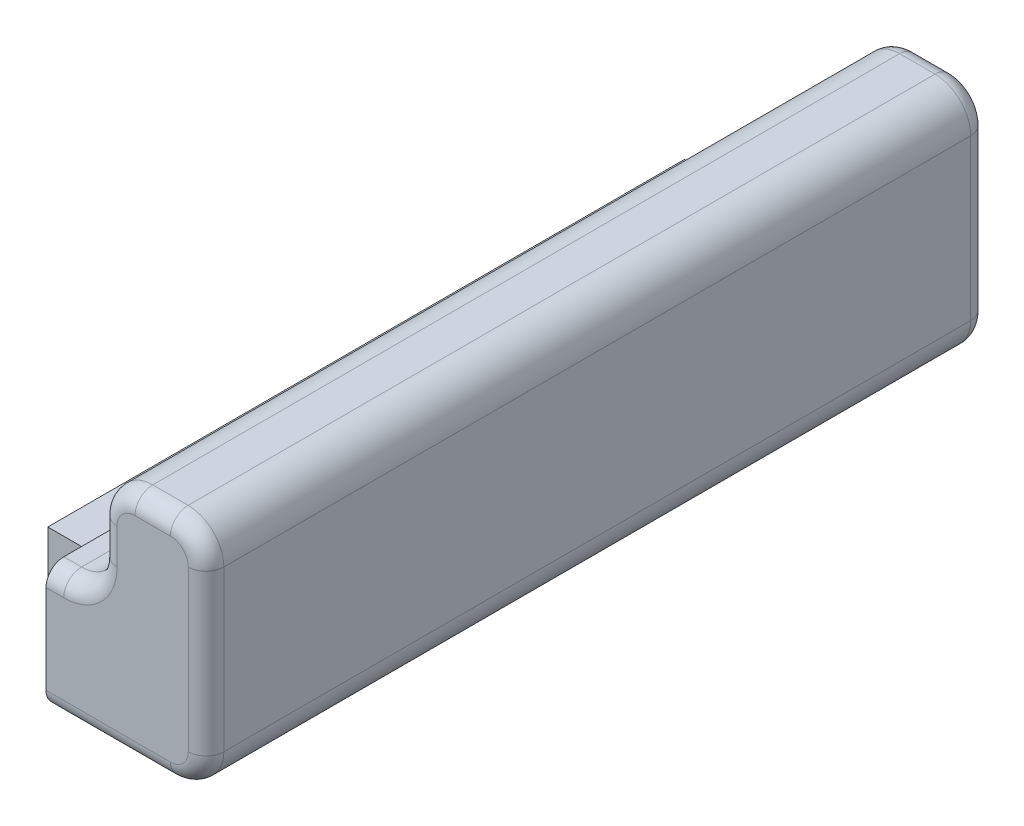
ISO-10303-21;
HEADER;
FILE_DESCRIPTION(('STEP AP214'),'2;1');
FILE_NAME('part.step','',(''),(''),'','','');
FILE_SCHEMA(('AUTOMOTIVE_DESIGN { 1 0 10303 214 1 1 1 1 }'));
ENDSEC;
DATA;
#1=APPLICATION_CONTEXT('core data for automotive mechanical design processes');
#2=APPLICATION_PROTOCOL_DEFINITION('international standard','automotive_design',2000,#1);
#3=PRODUCT_CONTEXT('',#1,'mechanical');
#4=PRODUCT('Part','Part','',(#3));
#5=PRODUCT_RELATED_PRODUCT_CATEGORY('part','',(#4));
#6=PRODUCT_DEFINITION_FORMATION('','',#4);
#7=PRODUCT_DEFINITION_CONTEXT('part definition',#1,'design');
#8=PRODUCT_DEFINITION('design','',#6,#7);
#9=PRODUCT_DEFINITION_SHAPE('','',#8);
#10=(LENGTH_UNIT() NAMED_UNIT(*) SI_UNIT(.MILLI.,.METRE.));
#11=(NAMED_UNIT(*) PLANE_ANGLE_UNIT() SI_UNIT($,.RADIAN.));
#12=(NAMED_UNIT(*) SI_UNIT($,.STERADIAN.) SOLID_ANGLE_UNIT());
#13=UNCERTAINTY_MEASURE_WITH_UNIT(LENGTH_MEASURE(1.E-05),#10,'distance_accuracy_value','');
#14=(GEOMETRIC_REPRESENTATION_CONTEXT(3) GLOBAL_UNCERTAINTY_ASSIGNED_CONTEXT((#13)) GLOBAL_UNIT_ASSIGNED_CONTEXT((#10,
#11,#12)) REPRESENTATION_CONTEXT('',''));
#15=CARTESIAN_POINT('',(0.,0.,0.));
#16=DIRECTION('',(0.,0.,1.));
#17=DIRECTION('',(1.,0.,0.));
#18=AXIS2_PLACEMENT_3D('',#15,#16,#17);
#19=CARTESIAN_POINT('',(-5.9507233877171,-1.66772154656018,22.));
#20=DIRECTION('',(1.,0.,0.));
#21=DIRECTION('',(0.,0.,-1.));
#22=AXIS2_PLACEMENT_3D('',#19,#20,#21);
#23=PLANE('',#22);
#24=DIRECTION('',(0.,0.,-1.));
#25=VECTOR('',#24,1.);
#26=CARTESIAN_POINT('',(-5.9507233877171,-5.16772154656018,22.));
#27=LINE('',#26,#25);
#28=CARTESIAN_POINT('',(-5.9507233877171,-5.16772154656018,21.5));
#29=VERTEX_POINT('',#28);
#30=CARTESIAN_POINT('',(-5.9507233877171,-5.16772154656018,0.5));
#31=VERTEX_POINT('',#30);
#32=EDGE_CURVE('E233',#29,#31,#27,.T.);
#33=ORIENTED_EDGE('',*,*,#32,.F.);
#34=CARTESIAN_POINT('',(-5.9507233877171,-4.66772154656018,21.5));
#35=DIRECTION('',(1.,0.,0.));
#36=DIRECTION('',(0.,0.,-1.));
#37=AXIS2_PLACEMENT_3D('',#34,#35,#36);
#38=CIRCLE('',#37,0.5);
#39=CARTESIAN_POINT('',(-5.9507233877171,-4.66772154656018,22.));
#40=VERTEX_POINT('',#39);
#41=EDGE_CURVE('E290',#29,#40,#38,.F.);
#42=ORIENTED_EDGE('',*,*,#41,.T.);
#43=DIRECTION('',(0.,-1.,0.));
#44=VECTOR('',#43,1.);
#45=CARTESIAN_POINT('',(-5.9507233877171,-1.66772154656018,22.));
#46=LINE('',#45,#44);
#47=CARTESIAN_POINT('',(-5.9507233877171,-2.16772154656018,22.));
#48=VERTEX_POINT('',#47);
#49=EDGE_CURVE('E223',#48,#40,#46,.T.);
#50=ORIENTED_EDGE('',*,*,#49,.F.);
#51=CARTESIAN_POINT('',(-5.9507233877171,-2.16772154656018,21.5));
#52=DIRECTION('',(1.,0.,0.));
#53=DIRECTION('',(0.,0.,-1.));
#54=AXIS2_PLACEMENT_3D('',#51,#52,#53);
#55=CIRCLE('',#54,0.5);
#56=CARTESIAN_POINT('',(-5.9507233877171,-1.66772154656018,21.5));
#57=VERTEX_POINT('',#56);
#58=EDGE_CURVE('E286',#48,#57,#55,.F.);
#59=ORIENTED_EDGE('',*,*,#58,.T.);
#60=DIRECTION('',(0.,0.,-1.));
#61=VECTOR('',#60,1.);
#62=CARTESIAN_POINT('',(-5.9507233877171,-1.66772154656018,22.));
#63=LINE('',#62,#61);
#64=CARTESIAN_POINT('',(-5.9507233877171,-1.66772154656018,0.5));
#65=VERTEX_POINT('',#64);
#66=EDGE_CURVE('E236',#57,#65,#63,.T.);
#67=ORIENTED_EDGE('',*,*,#66,.T.);
#68=CARTESIAN_POINT('',(-5.9507233877171,-2.16772154656018,0.5));
#69=DIRECTION('',(1.,0.,0.));
#70=DIRECTION('',(0.,0.,-1.));
#71=AXIS2_PLACEMENT_3D('',#68,#69,#70);
#72=CIRCLE('',#71,0.5);
#73=CARTESIAN_POINT('',(-5.9507233877171,-2.16772154656018,0.));
#74=VERTEX_POINT('',#73);
#75=EDGE_CURVE('E284',#65,#74,#72,.F.);
#76=ORIENTED_EDGE('',*,*,#75,.T.);
#77=DIRECTION('',(0.,-1.,0.));
#78=VECTOR('',#77,1.);
#79=CARTESIAN_POINT('',(-5.9507233877171,-1.66772154656018,0.));
#80=LINE('',#79,#78);
#81=CARTESIAN_POINT('',(-5.9507233877171,-4.66772154656018,0.));
#82=VERTEX_POINT('',#81);
#83=EDGE_CURVE('E227',#74,#82,#80,.T.);
#84=ORIENTED_EDGE('',*,*,#83,.T.);
#85=CARTESIAN_POINT('',(-5.9507233877171,-4.66772154656018,0.5));
#86=DIRECTION('',(1.,0.,0.));
#87=DIRECTION('',(0.,0.,-1.));
#88=AXIS2_PLACEMENT_3D('',#85,#86,#87);
#89=CIRCLE('',#88,0.5);
#90=EDGE_CURVE('E288',#82,#31,#89,.F.);
#91=ORIENTED_EDGE('',*,*,#90,.T.);
#92=EDGE_LOOP('',(#33,#42,#50,#59,#67,#76,#84,#91));
#93=FACE_BOUND('',#92,.T.);
#94=DIRECTION('',(0.,-1.,0.));
#95=VECTOR('',#94,1.);
#96=CARTESIAN_POINT('',(-5.9507233877171,-2.71772154656018,2.05));
#97=LINE('',#96,#95);
#98=CARTESIAN_POINT('',(-5.9507233877171,-2.71772154656018,2.05));
#99=VERTEX_POINT('',#98);
#100=CARTESIAN_POINT('',(-5.9507233877171,-4.11772154656018,2.05));
#101=VERTEX_POINT('',#100);
#102=EDGE_CURVE('E50',#99,#101,#97,.T.);
#103=ORIENTED_EDGE('',*,*,#102,.F.);
#104=DIRECTION('',(0.,0.,-1.));
#105=VECTOR('',#104,1.);
#106=CARTESIAN_POINT('',(-5.9507233877171,-2.71772154656018,2.05));
#107=LINE('',#106,#105);
#108=CARTESIAN_POINT('',(-5.9507233877171,-2.71772154656018,19.95));
#109=VERTEX_POINT('',#108);
#110=EDGE_CURVE('E54',#109,#99,#107,.T.);
#111=ORIENTED_EDGE('',*,*,#110,.F.);
#112=DIRECTION('',(0.,1.,0.));
#113=VECTOR('',#112,1.);
#114=CARTESIAN_POINT('',(-5.9507233877171,-2.71772154656018,19.95));
#115=LINE('',#114,#113);
#116=CARTESIAN_POINT('',(-5.9507233877171,-4.11772154656018,19.95));
#117=VERTEX_POINT('',#116);
#118=EDGE_CURVE('E788',#117,#109,#115,.T.);
#119=ORIENTED_EDGE('',*,*,#118,.F.);
#120=DIRECTION('',(0.,0.,1.));
#121=VECTOR('',#120,1.);
#122=CARTESIAN_POINT('',(-5.9507233877171,-4.11772154656018,2.05));
#123=LINE('',#122,#121);
#124=EDGE_CURVE('E794',#101,#117,#123,.T.);
#125=ORIENTED_EDGE('',*,*,#124,.F.);
#126=EDGE_LOOP('',(#103,#111,#119,#125));
#127=FACE_BOUND('',#126,.T.);
#128=ADVANCED_FACE('F33',(#93,#127),#23,.F.);
#129=CARTESIAN_POINT('',(-2.45284962289796,-4.16559531137933,22.));
#130=DIRECTION('',(0.,0.,-1.));
#131=DIRECTION('',(-1.,0.,0.));
#132=AXIS2_PLACEMENT_3D('',#129,#130,#131);
#133=CYLINDRICAL_SURFACE('',#132,1.00212623518086);
#134=DIRECTION('',(0.,0.,-1.));
#135=VECTOR('',#134,1.);
#136=CARTESIAN_POINT('',(-1.4507233877171,-4.16559531137933,22.));
#137=LINE('',#136,#135);
#138=CARTESIAN_POINT('',(-1.4507233877171,-4.16559531137933,21.5));
#139=VERTEX_POINT('',#138);
#140=CARTESIAN_POINT('',(-1.4507233877171,-4.16559531137933,0.5));
#141=VERTEX_POINT('',#140);
#142=EDGE_CURVE('E257',#139,#141,#137,.T.);
#143=ORIENTED_EDGE('',*,*,#142,.F.);
#144=CARTESIAN_POINT('',(-2.45284962289796,-4.16559531137933,21.5));
#145=DIRECTION('',(0.,0.,-1.));
#146=DIRECTION('',(-1.,0.,0.));
#147=AXIS2_PLACEMENT_3D('',#144,#145,#146);
#148=CIRCLE('',#147,1.00212623518086);
#149=CARTESIAN_POINT('',(-2.45284962289796,-5.16772154656018,21.5));
#150=VERTEX_POINT('',#149);
#151=EDGE_CURVE('E11',#139,#150,#148,.T.);
#152=ORIENTED_EDGE('',*,*,#151,.T.);
#153=DIRECTION('',(0.,0.,-1.));
#154=VECTOR('',#153,1.);
#155=CARTESIAN_POINT('',(-2.45284962289796,-5.16772154656018,22.));
#156=LINE('',#155,#154);
#157=CARTESIAN_POINT('',(-2.45284962289796,-5.16772154656018,0.5));
#158=VERTEX_POINT('',#157);
#159=EDGE_CURVE('E226',#150,#158,#156,.T.);
#160=ORIENTED_EDGE('',*,*,#159,.T.);
#161=CARTESIAN_POINT('',(-2.45284962289796,-4.16559531137933,0.5));
#162=DIRECTION('',(0.,0.,-1.));
#163=DIRECTION('',(-1.,0.,0.));
#164=AXIS2_PLACEMENT_3D('',#161,#162,#163);
#165=CIRCLE('',#164,1.00212623518086);
#166=EDGE_CURVE('E42',#158,#141,#165,.F.);
#167=ORIENTED_EDGE('',*,*,#166,.T.);
#168=EDGE_LOOP('',(#143,#152,#160,#167));
#169=FACE_BOUND('',#168,.T.);
#170=ADVANCED_FACE('F461',(#169),#133,.T.);
#171=CARTESIAN_POINT('',(-1.4507233877171,0.332278453427185,22.));
#172=DIRECTION('',(-1.,0.,0.));
#173=DIRECTION('',(0.,0.,1.));
#174=AXIS2_PLACEMENT_3D('',#171,#172,#173);
#175=PLANE('',#174);
#176=DIRECTION('',(0.,0.,-1.));
#177=VECTOR('',#176,1.);
#178=CARTESIAN_POINT('',(-1.4507233877171,0.332278453427185,22.));
#179=LINE('',#178,#177);
#180=CARTESIAN_POINT('',(-1.4507233877171,0.332278453427185,21.5));
#181=VERTEX_POINT('',#180);
#182=CARTESIAN_POINT('',(-1.4507233877171,0.332278453427185,0.5));
#183=VERTEX_POINT('',#182);
#184=EDGE_CURVE('E254',#181,#183,#179,.T.);
#185=ORIENTED_EDGE('',*,*,#184,.F.);
#186=DIRECTION('',(0.,1.,0.));
#187=VECTOR('',#186,1.);
#188=CARTESIAN_POINT('',(-1.4507233877171,0.332278453427185,21.5));
#189=LINE('',#188,#187);
#190=EDGE_CURVE('E336',#181,#139,#189,.F.);
#191=ORIENTED_EDGE('',*,*,#190,.T.);
#192=ORIENTED_EDGE('',*,*,#142,.T.);
#193=DIRECTION('',(0.,1.,0.));
#194=VECTOR('',#193,1.);
#195=CARTESIAN_POINT('',(-1.4507233877171,0.332278453427185,0.5));
#196=LINE('',#195,#194);
#197=EDGE_CURVE('E334',#141,#183,#196,.T.);
#198=ORIENTED_EDGE('',*,*,#197,.T.);
#199=EDGE_LOOP('',(#185,#191,#192,#198));
#200=FACE_BOUND('',#199,.T.);
#201=ADVANCED_FACE('F466',(#200),#175,.F.);
#202=CARTESIAN_POINT('',(-2.45284962289796,0.332278453427185,22.));
#203=DIRECTION('',(0.,0.,-1.));
#204=DIRECTION('',(-1.,0.,0.));
#205=AXIS2_PLACEMENT_3D('',#202,#203,#204);
#206=CYLINDRICAL_SURFACE('',#205,1.00212623518086);
#207=DIRECTION('',(0.,0.,-1.));
#208=VECTOR('',#207,1.);
#209=CARTESIAN_POINT('',(-2.45284962289796,1.33440468860804,22.));
#210=LINE('',#209,#208);
#211=CARTESIAN_POINT('',(-2.45284962289796,1.33440468860804,21.5));
#212=VERTEX_POINT('',#211);
#213=CARTESIAN_POINT('',(-2.45284962289796,1.33440468860804,0.5));
#214=VERTEX_POINT('',#213);
#215=EDGE_CURVE('E251',#212,#214,#210,.T.);
#216=ORIENTED_EDGE('',*,*,#215,.F.);
#217=CARTESIAN_POINT('',(-2.45284962289796,0.332278453427185,21.5));
#218=DIRECTION('',(0.,0.,-1.));
#219=DIRECTION('',(-1.,0.,0.));
#220=AXIS2_PLACEMENT_3D('',#217,#218,#219);
#221=CIRCLE('',#220,1.00212623518086);
#222=EDGE_CURVE('E332',#212,#181,#221,.T.);
#223=ORIENTED_EDGE('',*,*,#222,.T.);
#224=ORIENTED_EDGE('',*,*,#184,.T.);
#225=CARTESIAN_POINT('',(-2.45284962289796,0.332278453427185,0.5));
#226=DIRECTION('',(0.,0.,-1.));
#227=DIRECTION('',(-1.,0.,0.));
#228=AXIS2_PLACEMENT_3D('',#225,#226,#227);
#229=CIRCLE('',#228,1.00212623518086);
#230=EDGE_CURVE('E330',#183,#214,#229,.F.);
#231=ORIENTED_EDGE('',*,*,#230,.T.);
#232=EDGE_LOOP('',(#216,#223,#224,#231));
#233=FACE_BOUND('',#232,.T.);
#234=ADVANCED_FACE('F483',(#233),#206,.T.);
#235=CARTESIAN_POINT('',(-3.44859715253625,1.33440468860804,22.));
#236=DIRECTION('',(0.,-1.,0.));
#237=DIRECTION('',(0.,0.,-1.));
#238=AXIS2_PLACEMENT_3D('',#235,#236,#237);
#239=PLANE('',#238);
#240=DIRECTION('',(0.,0.,-1.));
#241=VECTOR('',#240,1.);
#242=CARTESIAN_POINT('',(-3.44859715253625,1.33440468860804,22.));
#243=LINE('',#242,#241);
#244=CARTESIAN_POINT('',(-3.44859715253625,1.33440468860804,21.5));
#245=VERTEX_POINT('',#244);
#246=CARTESIAN_POINT('',(-3.44859715253625,1.33440468860804,0.5));
#247=VERTEX_POINT('',#246);
#248=EDGE_CURVE('E248',#245,#247,#243,.T.);
#249=ORIENTED_EDGE('',*,*,#248,.F.);
#250=DIRECTION('',(-1.,0.,0.));
#251=VECTOR('',#250,1.);
#252=CARTESIAN_POINT('',(-3.44859715253625,1.33440468860804,21.5));
#253=LINE('',#252,#251);
#254=EDGE_CURVE('E320',#245,#212,#253,.F.);
#255=ORIENTED_EDGE('',*,*,#254,.T.);
#256=ORIENTED_EDGE('',*,*,#215,.T.);
#257=DIRECTION('',(-1.,0.,0.));
#258=VECTOR('',#257,1.);
#259=CARTESIAN_POINT('',(-3.44859715253625,1.33440468860804,0.5));
#260=LINE('',#259,#258);
#261=EDGE_CURVE('E318',#214,#247,#260,.T.);
#262=ORIENTED_EDGE('',*,*,#261,.T.);
#263=EDGE_LOOP('',(#249,#255,#256,#262));
#264=FACE_BOUND('',#263,.T.);
#265=ADVANCED_FACE('F431',(#264),#239,.F.);
#266=CARTESIAN_POINT('',(-3.44859715253625,0.332278453427185,22.));
#267=DIRECTION('',(0.,0.,-1.));
#268=DIRECTION('',(-1.,0.,0.));
#269=AXIS2_PLACEMENT_3D('',#266,#267,#268);
#270=CYLINDRICAL_SURFACE('',#269,1.00212623518086);
#271=DIRECTION('',(0.,0.,-1.));
#272=VECTOR('',#271,1.);
#273=CARTESIAN_POINT('',(-4.4507233877171,0.332278453427185,22.));
#274=LINE('',#273,#272);
#275=CARTESIAN_POINT('',(-4.4507233877171,0.332278453427185,21.5));
#276=VERTEX_POINT('',#275);
#277=CARTESIAN_POINT('',(-4.4507233877171,0.332278453427185,0.5));
#278=VERTEX_POINT('',#277);
#279=EDGE_CURVE('E245',#276,#278,#274,.T.);
#280=ORIENTED_EDGE('',*,*,#279,.F.);
#281=CARTESIAN_POINT('',(-3.44859715253625,0.332278453427185,21.5));
#282=DIRECTION('',(0.,0.,-1.));
#283=DIRECTION('',(-1.,0.,0.));
#284=AXIS2_PLACEMENT_3D('',#281,#282,#283);
#285=CIRCLE('',#284,1.00212623518086);
#286=EDGE_CURVE('E324',#276,#245,#285,.T.);
#287=ORIENTED_EDGE('',*,*,#286,.T.);
#288=ORIENTED_EDGE('',*,*,#248,.T.);
#289=CARTESIAN_POINT('',(-3.44859715253625,0.332278453427185,0.5));
#290=DIRECTION('',(0.,0.,-1.));
#291=DIRECTION('',(-1.,0.,0.));
#292=AXIS2_PLACEMENT_3D('',#289,#290,#291);
#293=CIRCLE('',#292,1.00212623518086);
#294=EDGE_CURVE('E322',#247,#278,#293,.F.);
#295=ORIENTED_EDGE('',*,*,#294,.T.);
#296=EDGE_LOOP('',(#280,#287,#288,#295));
#297=FACE_BOUND('',#296,.T.);
#298=ADVANCED_FACE('F428',(#297),#270,.T.);
#299=CARTESIAN_POINT('',(-4.4507233877171,-0.665595311379329,22.));
#300=DIRECTION('',(1.,0.,0.));
#301=DIRECTION('',(0.,0.,-1.));
#302=AXIS2_PLACEMENT_3D('',#299,#300,#301);
#303=PLANE('',#302);
#304=DIRECTION('',(0.,0.,-1.));
#305=VECTOR('',#304,1.);
#306=CARTESIAN_POINT('',(-4.4507233877171,-0.665595311379329,22.));
#307=LINE('',#306,#305);
#308=CARTESIAN_POINT('',(-4.4507233877171,-0.665595311379329,21.5));
#309=VERTEX_POINT('',#308);
#310=CARTESIAN_POINT('',(-4.4507233877171,-0.665595311379329,0.5));
#311=VERTEX_POINT('',#310);
#312=EDGE_CURVE('E242',#309,#311,#307,.T.);
#313=ORIENTED_EDGE('',*,*,#312,.F.);
#314=DIRECTION('',(0.,-1.,0.));
#315=VECTOR('',#314,1.);
#316=CARTESIAN_POINT('',(-4.4507233877171,-0.665595311379329,21.5));
#317=LINE('',#316,#315);
#318=EDGE_CURVE('E328',#309,#276,#317,.F.);
#319=ORIENTED_EDGE('',*,*,#318,.T.);
#320=ORIENTED_EDGE('',*,*,#279,.T.);
#321=DIRECTION('',(0.,-1.,0.));
#322=VECTOR('',#321,1.);
#323=CARTESIAN_POINT('',(-4.4507233877171,-0.665595311379329,0.5));
#324=LINE('',#323,#322);
#325=EDGE_CURVE('E326',#278,#311,#324,.T.);
#326=ORIENTED_EDGE('',*,*,#325,.T.);
#327=EDGE_LOOP('',(#313,#319,#320,#326));
#328=FACE_BOUND('',#327,.T.);
#329=ADVANCED_FACE('F410',(#328),#303,.F.);
#330=CARTESIAN_POINT('',(-5.45284962289796,-0.665595311379329,22.));
#331=DIRECTION('',(0.,0.,-1.));
#332=DIRECTION('',(-1.,0.,0.));
#333=AXIS2_PLACEMENT_3D('',#330,#331,#332);
#334=CYLINDRICAL_SURFACE('',#333,1.00212623518086);
#335=DIRECTION('',(0.,0.,-1.));
#336=VECTOR('',#335,1.);
#337=CARTESIAN_POINT('',(-5.45284962289796,-1.66772154656019,22.));
#338=LINE('',#337,#336);
#339=CARTESIAN_POINT('',(-5.45284962289796,-1.66772154656019,21.5));
#340=VERTEX_POINT('',#339);
#341=CARTESIAN_POINT('',(-5.45284962289796,-1.66772154656019,0.5));
#342=VERTEX_POINT('',#341);
#343=EDGE_CURVE('E239',#340,#342,#338,.T.);
#344=ORIENTED_EDGE('',*,*,#343,.F.);
#345=CARTESIAN_POINT('',(-5.45284962289796,-0.665595311379329,21.5));
#346=DIRECTION('',(0.,0.,-1.));
#347=DIRECTION('',(-1.,0.,0.));
#348=AXIS2_PLACEMENT_3D('',#345,#346,#347);
#349=CIRCLE('',#348,1.00212623518086);
#350=EDGE_CURVE('E316',#340,#309,#349,.F.);
#351=ORIENTED_EDGE('',*,*,#350,.T.);
#352=ORIENTED_EDGE('',*,*,#312,.T.);
#353=CARTESIAN_POINT('',(-5.45284962289796,-0.665595311379329,0.5));
#354=DIRECTION('',(0.,0.,-1.));
#355=DIRECTION('',(-1.,0.,0.));
#356=AXIS2_PLACEMENT_3D('',#353,#354,#355);
#357=CIRCLE('',#356,1.00212623518086);
#358=EDGE_CURVE('E314',#311,#342,#357,.T.);
#359=ORIENTED_EDGE('',*,*,#358,.T.);
#360=EDGE_LOOP('',(#344,#351,#352,#359));
#361=FACE_BOUND('',#360,.T.);
#362=ADVANCED_FACE('F406',(#361),#334,.F.);
#363=CARTESIAN_POINT('',(-5.9507233877171,-1.66772154656018,22.));
#364=DIRECTION('',(0.,-1.,0.));
#365=DIRECTION('',(1.,0.,0.));
#366=AXIS2_PLACEMENT_3D('',#363,#364,#365);
#367=PLANE('',#366);
#368=ORIENTED_EDGE('',*,*,#66,.F.);
#369=DIRECTION('',(-1.,0.,0.));
#370=VECTOR('',#369,1.);
#371=CARTESIAN_POINT('',(-5.9507233877171,-1.66772154656018,21.5));
#372=LINE('',#371,#370);
#373=EDGE_CURVE('E312',#57,#340,#372,.F.);
#374=ORIENTED_EDGE('',*,*,#373,.T.);
#375=ORIENTED_EDGE('',*,*,#343,.T.);
#376=DIRECTION('',(-1.,0.,0.));
#377=VECTOR('',#376,1.);
#378=CARTESIAN_POINT('',(-5.9507233877171,-1.66772154656018,0.5));
#379=LINE('',#378,#377);
#380=EDGE_CURVE('E310',#342,#65,#379,.T.);
#381=ORIENTED_EDGE('',*,*,#380,.T.);
#382=EDGE_LOOP('',(#368,#374,#375,#381));
#383=FACE_BOUND('',#382,.T.);
#384=ADVANCED_FACE('F392',(#383),#367,.F.);
#385=CARTESIAN_POINT('',(-5.9507233877171,-5.16772154656018,22.));
#386=DIRECTION('',(0.,1.,0.));
#387=DIRECTION('',(0.,0.,1.));
#388=AXIS2_PLACEMENT_3D('',#385,#386,#387);
#389=PLANE('',#388);
#390=ORIENTED_EDGE('',*,*,#159,.F.);
#391=DIRECTION('',(1.,0.,0.));
#392=VECTOR('',#391,1.);
#393=CARTESIAN_POINT('',(-5.9507233877171,-5.16772154656018,21.5));
#394=LINE('',#393,#392);
#395=EDGE_CURVE('E282',#150,#29,#394,.F.);
#396=ORIENTED_EDGE('',*,*,#395,.T.);
#397=ORIENTED_EDGE('',*,*,#32,.T.);
#398=DIRECTION('',(1.,0.,0.));
#399=VECTOR('',#398,1.);
#400=CARTESIAN_POINT('',(-2.45284962289796,-5.16772154656018,0.5));
#401=LINE('',#400,#399);
#402=EDGE_CURVE('E279',#31,#158,#401,.T.);
#403=ORIENTED_EDGE('',*,*,#402,.T.);
#404=EDGE_LOOP('',(#390,#396,#397,#403));
#405=FACE_BOUND('',#404,.T.);
#406=ADVANCED_FACE('F471',(#405),#389,.F.);
#407=CARTESIAN_POINT('',(-2.45284962289796,-4.16559531137933,22.));
#408=DIRECTION('',(0.,0.,-1.));
#409=DIRECTION('',(-1.,0.,0.));
#410=AXIS2_PLACEMENT_3D('',#407,#408,#409);
#411=PLANE('',#410);
#412=CARTESIAN_POINT('',(-5.45284962289796,-0.665595311379329,22.));
#413=DIRECTION('',(0.,0.,-1.));
#414=DIRECTION('',(-1.,0.,0.));
#415=AXIS2_PLACEMENT_3D('',#412,#413,#414);
#416=CIRCLE('',#415,1.50212623518086);
#417=CARTESIAN_POINT('',(-3.9507233877171,-0.665595311379329,22.));
#418=VERTEX_POINT('',#417);
#419=CARTESIAN_POINT('',(-5.45284962289796,-2.16772154656019,22.));
#420=VERTEX_POINT('',#419);
#421=EDGE_CURVE('E275',#418,#420,#416,.T.);
#422=ORIENTED_EDGE('',*,*,#421,.T.);
#423=DIRECTION('',(-1.,0.,0.));
#424=VECTOR('',#423,1.);
#425=CARTESIAN_POINT('',(-2.45284962289794,-2.1677215465602,22.));
#426=LINE('',#425,#424);
#427=EDGE_CURVE('E277',#420,#48,#426,.T.);
#428=ORIENTED_EDGE('',*,*,#427,.T.);
#429=ORIENTED_EDGE('',*,*,#49,.T.);
#430=DIRECTION('',(1.,0.,0.));
#431=VECTOR('',#430,1.);
#432=CARTESIAN_POINT('',(-2.45284962289796,-4.66772154656018,22.));
#433=LINE('',#432,#431);
#434=CARTESIAN_POINT('',(-2.45284962289796,-4.66772154656018,22.));
#435=VERTEX_POINT('',#434);
#436=EDGE_CURVE('E268',#40,#435,#433,.T.);
#437=ORIENTED_EDGE('',*,*,#436,.T.);
#438=CARTESIAN_POINT('',(-2.45284962289796,-4.16559531137933,22.));
#439=DIRECTION('',(0.,0.,-1.));
#440=DIRECTION('',(-1.,0.,0.));
#441=AXIS2_PLACEMENT_3D('',#438,#439,#440);
#442=CIRCLE('',#441,0.502126235180856);
#443=CARTESIAN_POINT('',(-1.9507233877171,-4.16559531137933,22.));
#444=VERTEX_POINT('',#443);
#445=EDGE_CURVE('E260',#435,#444,#442,.F.);
#446=ORIENTED_EDGE('',*,*,#445,.T.);
#447=DIRECTION('',(0.,1.,0.));
#448=VECTOR('',#447,1.);
#449=CARTESIAN_POINT('',(-1.9507233877171,-4.16559531137933,22.));
#450=LINE('',#449,#448);
#451=CARTESIAN_POINT('',(-1.9507233877171,0.332278453427185,22.));
#452=VERTEX_POINT('',#451);
#453=EDGE_CURVE('E262',#444,#452,#450,.T.);
#454=ORIENTED_EDGE('',*,*,#453,.T.);
#455=CARTESIAN_POINT('',(-2.45284962289796,0.332278453427185,22.));
#456=DIRECTION('',(0.,0.,-1.));
#457=DIRECTION('',(-1.,0.,0.));
#458=AXIS2_PLACEMENT_3D('',#455,#456,#457);
#459=CIRCLE('',#458,0.502126235180856);
#460=CARTESIAN_POINT('',(-2.45284962289796,0.834404688608041,22.));
#461=VERTEX_POINT('',#460);
#462=EDGE_CURVE('E264',#452,#461,#459,.F.);
#463=ORIENTED_EDGE('',*,*,#462,.T.);
#464=DIRECTION('',(-1.,0.,0.));
#465=VECTOR('',#464,1.);
#466=CARTESIAN_POINT('',(-2.45284962289796,0.834404688608041,22.));
#467=LINE('',#466,#465);
#468=CARTESIAN_POINT('',(-3.44859715253625,0.834404688608041,22.));
#469=VERTEX_POINT('',#468);
#470=EDGE_CURVE('E266',#461,#469,#467,.T.);
#471=ORIENTED_EDGE('',*,*,#470,.T.);
#472=CARTESIAN_POINT('',(-3.44859715253625,0.332278453427185,22.));
#473=DIRECTION('',(0.,0.,-1.));
#474=DIRECTION('',(-1.,0.,0.));
#475=AXIS2_PLACEMENT_3D('',#472,#473,#474);
#476=CIRCLE('',#475,0.502126235180856);
#477=CARTESIAN_POINT('',(-3.9507233877171,0.332278453427185,22.));
#478=VERTEX_POINT('',#477);
#479=EDGE_CURVE('E271',#469,#478,#476,.F.);
#480=ORIENTED_EDGE('',*,*,#479,.T.);
#481=DIRECTION('',(0.,-1.,0.));
#482=VECTOR('',#481,1.);
#483=CARTESIAN_POINT('',(-3.9507233877171,-4.16559531137933,22.));
#484=LINE('',#483,#482);
#485=EDGE_CURVE('E273',#478,#418,#484,.T.);
#486=ORIENTED_EDGE('',*,*,#485,.T.);
#487=EDGE_LOOP('',(#422,#428,#429,#437,#446,#454,#463,#471,#480,#486));
#488=FACE_BOUND('',#487,.T.);
#489=ADVANCED_FACE('F683',(#488),#411,.F.);
#490=CARTESIAN_POINT('',(-2.45284962289796,-4.16559531137933,0.));
#491=DIRECTION('',(0.,0.,-1.));
#492=DIRECTION('',(-1.,0.,0.));
#493=AXIS2_PLACEMENT_3D('',#490,#491,#492);
#494=PLANE('',#493);
#495=ORIENTED_EDGE('',*,*,#83,.F.);
#496=DIRECTION('',(-1.,0.,0.));
#497=VECTOR('',#496,1.);
#498=CARTESIAN_POINT('',(-5.45284962289796,-2.16772154656019,0.));
#499=LINE('',#498,#497);
#500=CARTESIAN_POINT('',(-5.45284962289796,-2.16772154656019,0.));
#501=VERTEX_POINT('',#500);
#502=EDGE_CURVE('E308',#74,#501,#499,.F.);
#503=ORIENTED_EDGE('',*,*,#502,.T.);
#504=CARTESIAN_POINT('',(-5.45284962289796,-0.665595311379329,0.));
#505=DIRECTION('',(0.,0.,-1.));
#506=DIRECTION('',(-1.,0.,0.));
#507=AXIS2_PLACEMENT_3D('',#504,#505,#506);
#508=CIRCLE('',#507,1.50212623518086);
#509=CARTESIAN_POINT('',(-3.9507233877171,-0.665595311379329,0.));
#510=VERTEX_POINT('',#509);
#511=EDGE_CURVE('E306',#501,#510,#508,.F.);
#512=ORIENTED_EDGE('',*,*,#511,.T.);
#513=DIRECTION('',(0.,-1.,0.));
#514=VECTOR('',#513,1.);
#515=CARTESIAN_POINT('',(-3.9507233877171,0.332278453427185,0.));
#516=LINE('',#515,#514);
#517=CARTESIAN_POINT('',(-3.9507233877171,0.332278453427185,0.));
#518=VERTEX_POINT('',#517);
#519=EDGE_CURVE('E302',#510,#518,#516,.F.);
#520=ORIENTED_EDGE('',*,*,#519,.T.);
#521=CARTESIAN_POINT('',(-3.44859715253625,0.332278453427185,0.));
#522=DIRECTION('',(0.,0.,-1.));
#523=DIRECTION('',(-1.,0.,0.));
#524=AXIS2_PLACEMENT_3D('',#521,#522,#523);
#525=CIRCLE('',#524,0.502126235180856);
#526=CARTESIAN_POINT('',(-3.44859715253625,0.834404688608041,0.));
#527=VERTEX_POINT('',#526);
#528=EDGE_CURVE('E300',#518,#527,#525,.T.);
#529=ORIENTED_EDGE('',*,*,#528,.T.);
#530=DIRECTION('',(-1.,0.,0.));
#531=VECTOR('',#530,1.);
#532=CARTESIAN_POINT('',(-2.45284962289796,0.834404688608041,0.));
#533=LINE('',#532,#531);
#534=CARTESIAN_POINT('',(-2.45284962289796,0.834404688608041,0.));
#535=VERTEX_POINT('',#534);
#536=EDGE_CURVE('E298',#527,#535,#533,.F.);
#537=ORIENTED_EDGE('',*,*,#536,.T.);
#538=CARTESIAN_POINT('',(-2.45284962289796,0.332278453427185,0.));
#539=DIRECTION('',(0.,0.,-1.));
#540=DIRECTION('',(-1.,0.,0.));
#541=AXIS2_PLACEMENT_3D('',#538,#539,#540);
#542=CIRCLE('',#541,0.502126235180856);
#543=CARTESIAN_POINT('',(-1.9507233877171,0.332278453427185,0.));
#544=VERTEX_POINT('',#543);
#545=EDGE_CURVE('E296',#535,#544,#542,.T.);
#546=ORIENTED_EDGE('',*,*,#545,.T.);
#547=DIRECTION('',(0.,1.,0.));
#548=VECTOR('',#547,1.);
#549=CARTESIAN_POINT('',(-1.9507233877171,-4.16559531137933,0.));
#550=LINE('',#549,#548);
#551=CARTESIAN_POINT('',(-1.9507233877171,-4.16559531137933,0.));
#552=VERTEX_POINT('',#551);
#553=EDGE_CURVE('E294',#544,#552,#550,.F.);
#554=ORIENTED_EDGE('',*,*,#553,.T.);
#555=CARTESIAN_POINT('',(-2.45284962289796,-4.16559531137933,0.));
#556=DIRECTION('',(0.,0.,-1.));
#557=DIRECTION('',(-1.,0.,0.));
#558=AXIS2_PLACEMENT_3D('',#555,#556,#557);
#559=CIRCLE('',#558,0.502126235180856);
#560=CARTESIAN_POINT('',(-2.45284962289796,-4.66772154656018,0.));
#561=VERTEX_POINT('',#560);
#562=EDGE_CURVE('E292',#552,#561,#559,.T.);
#563=ORIENTED_EDGE('',*,*,#562,.T.);
#564=DIRECTION('',(1.,0.,0.));
#565=VECTOR('',#564,1.);
#566=CARTESIAN_POINT('',(-5.9507233877171,-4.66772154656018,0.));
#567=LINE('',#566,#565);
#568=EDGE_CURVE('E304',#561,#82,#567,.F.);
#569=ORIENTED_EDGE('',*,*,#568,.T.);
#570=EDGE_LOOP('',(#495,#503,#512,#520,#529,#537,#546,#554,#563,#569));
#571=FACE_BOUND('',#570,.T.);
#572=ADVANCED_FACE('F446',(#571),#494,.T.);
#573=CARTESIAN_POINT('',(-2.45284962289794,-2.1677215465602,21.5));
#574=DIRECTION('',(-1.,0.,0.));
#575=DIRECTION('',(0.,-1.,0.));
#576=AXIS2_PLACEMENT_3D('',#573,#574,#575);
#577=CYLINDRICAL_SURFACE('',#576,0.5);
#578=ORIENTED_EDGE('',*,*,#58,.F.);
#579=ORIENTED_EDGE('',*,*,#427,.F.);
#580=CARTESIAN_POINT('',(-5.45284962289796,-2.16772154656019,21.5));
#581=DIRECTION('',(1.,0.,0.));
#582=DIRECTION('',(0.,1.,0.));
#583=AXIS2_PLACEMENT_3D('',#580,#581,#582);
#584=CIRCLE('',#583,0.5);
#585=EDGE_CURVE('E230',#340,#420,#584,.T.);
#586=ORIENTED_EDGE('',*,*,#585,.F.);
#587=ORIENTED_EDGE('',*,*,#373,.F.);
#588=EDGE_LOOP('',(#578,#579,#586,#587));
#589=FACE_BOUND('',#588,.T.);
#590=ADVANCED_FACE('F402',(#589),#577,.T.);
#591=CARTESIAN_POINT('',(-5.45284962289796,-0.665595311379329,21.5));
#592=DIRECTION('',(0.,0.,-1.));
#593=DIRECTION('',(-1.,0.,0.));
#594=AXIS2_PLACEMENT_3D('',#591,#592,#593);
#595=TOROIDAL_SURFACE('',#594,1.50212623518086,0.5);
#596=ORIENTED_EDGE('',*,*,#585,.T.);
#597=ORIENTED_EDGE('',*,*,#421,.F.);
#598=CARTESIAN_POINT('',(-3.9507233877171,-0.665595311379329,21.5));
#599=DIRECTION('',(0.,1.,0.));
#600=DIRECTION('',(0.,0.,1.));
#601=AXIS2_PLACEMENT_3D('',#598,#599,#600);
#602=CIRCLE('',#601,0.5);
#603=EDGE_CURVE('E356',#309,#418,#602,.T.);
#604=ORIENTED_EDGE('',*,*,#603,.F.);
#605=ORIENTED_EDGE('',*,*,#350,.F.);
#606=EDGE_LOOP('',(#596,#597,#604,#605));
#607=FACE_BOUND('',#606,.T.);
#608=ADVANCED_FACE('F415',(#607),#595,.T.);
#609=CARTESIAN_POINT('',(-3.9507233877171,-4.16559531137933,21.5));
#610=DIRECTION('',(0.,-1.,0.));
#611=DIRECTION('',(0.,0.,-1.));
#612=AXIS2_PLACEMENT_3D('',#609,#610,#611);
#613=CYLINDRICAL_SURFACE('',#612,0.5);
#614=ORIENTED_EDGE('',*,*,#603,.T.);
#615=ORIENTED_EDGE('',*,*,#485,.F.);
#616=CARTESIAN_POINT('',(-3.9507233877171,0.332278453427185,21.5));
#617=DIRECTION('',(0.,1.,0.));
#618=DIRECTION('',(0.,0.,1.));
#619=AXIS2_PLACEMENT_3D('',#616,#617,#618);
#620=CIRCLE('',#619,0.5);
#621=EDGE_CURVE('E353',#276,#478,#620,.T.);
#622=ORIENTED_EDGE('',*,*,#621,.F.);
#623=ORIENTED_EDGE('',*,*,#318,.F.);
#624=EDGE_LOOP('',(#614,#615,#622,#623));
#625=FACE_BOUND('',#624,.T.);
#626=ADVANCED_FACE('F419',(#625),#613,.T.);
#627=CARTESIAN_POINT('',(-3.44859715253625,0.332278453427185,21.5));
#628=DIRECTION('',(0.,0.,-1.));
#629=DIRECTION('',(-1.,0.,0.));
#630=AXIS2_PLACEMENT_3D('',#627,#628,#629);
#631=TOROIDAL_SURFACE('',#630,0.502126235180856,0.5);
#632=ORIENTED_EDGE('',*,*,#621,.T.);
#633=ORIENTED_EDGE('',*,*,#479,.F.);
#634=CARTESIAN_POINT('',(-3.44859715253625,0.834404688608041,21.5));
#635=DIRECTION('',(1.,0.,0.));
#636=DIRECTION('',(0.,0.,-1.));
#637=AXIS2_PLACEMENT_3D('',#634,#635,#636);
#638=CIRCLE('',#637,0.5);
#639=EDGE_CURVE('E350',#245,#469,#638,.T.);
#640=ORIENTED_EDGE('',*,*,#639,.F.);
#641=ORIENTED_EDGE('',*,*,#286,.F.);
#642=EDGE_LOOP('',(#632,#633,#640,#641));
#643=FACE_BOUND('',#642,.T.);
#644=ADVANCED_FACE('F424',(#643),#631,.T.);
#645=CARTESIAN_POINT('',(-2.45284962289796,0.834404688608041,21.5));
#646=DIRECTION('',(-1.,0.,0.));
#647=DIRECTION('',(0.,0.,1.));
#648=AXIS2_PLACEMENT_3D('',#645,#646,#647);
#649=CYLINDRICAL_SURFACE('',#648,0.5);
#650=ORIENTED_EDGE('',*,*,#639,.T.);
#651=ORIENTED_EDGE('',*,*,#470,.F.);
#652=CARTESIAN_POINT('',(-2.45284962289796,0.834404688608041,21.5));
#653=DIRECTION('',(1.,0.,0.));
#654=DIRECTION('',(0.,0.,-1.));
#655=AXIS2_PLACEMENT_3D('',#652,#653,#654);
#656=CIRCLE('',#655,0.5);
#657=EDGE_CURVE('E347',#212,#461,#656,.T.);
#658=ORIENTED_EDGE('',*,*,#657,.F.);
#659=ORIENTED_EDGE('',*,*,#254,.F.);
#660=EDGE_LOOP('',(#650,#651,#658,#659));
#661=FACE_BOUND('',#660,.T.);
#662=ADVANCED_FACE('F505',(#661),#649,.T.);
#663=CARTESIAN_POINT('',(-2.45284962289796,0.332278453427185,21.5));
#664=DIRECTION('',(0.,0.,-1.));
#665=DIRECTION('',(-1.,0.,0.));
#666=AXIS2_PLACEMENT_3D('',#663,#664,#665);
#667=TOROIDAL_SURFACE('',#666,0.502126235180856,0.5);
#668=ORIENTED_EDGE('',*,*,#657,.T.);
#669=ORIENTED_EDGE('',*,*,#462,.F.);
#670=CARTESIAN_POINT('',(-1.9507233877171,0.332278453427185,21.5));
#671=DIRECTION('',(0.,-1.,0.));
#672=DIRECTION('',(1.,0.,0.));
#673=AXIS2_PLACEMENT_3D('',#670,#671,#672);
#674=CIRCLE('',#673,0.5);
#675=EDGE_CURVE('E344',#181,#452,#674,.T.);
#676=ORIENTED_EDGE('',*,*,#675,.F.);
#677=ORIENTED_EDGE('',*,*,#222,.F.);
#678=EDGE_LOOP('',(#668,#669,#676,#677));
#679=FACE_BOUND('',#678,.T.);
#680=ADVANCED_FACE('F501',(#679),#667,.T.);
#681=CARTESIAN_POINT('',(-1.9507233877171,-4.16559531137933,21.5));
#682=DIRECTION('',(0.,1.,0.));
#683=DIRECTION('',(0.,0.,1.));
#684=AXIS2_PLACEMENT_3D('',#681,#682,#683);
#685=CYLINDRICAL_SURFACE('',#684,0.5);
#686=ORIENTED_EDGE('',*,*,#675,.T.);
#687=ORIENTED_EDGE('',*,*,#453,.F.);
#688=CARTESIAN_POINT('',(-1.9507233877171,-4.16559531137933,21.5));
#689=DIRECTION('',(0.,-1.,0.));
#690=DIRECTION('',(0.,0.,-1.));
#691=AXIS2_PLACEMENT_3D('',#688,#689,#690);
#692=CIRCLE('',#691,0.5);
#693=EDGE_CURVE('E341',#139,#444,#692,.T.);
#694=ORIENTED_EDGE('',*,*,#693,.F.);
#695=ORIENTED_EDGE('',*,*,#190,.F.);
#696=EDGE_LOOP('',(#686,#687,#694,#695));
#697=FACE_BOUND('',#696,.T.);
#698=ADVANCED_FACE('F497',(#697),#685,.T.);
#699=CARTESIAN_POINT('',(-2.45284962289796,-4.16559531137933,21.5));
#700=DIRECTION('',(0.,0.,-1.));
#701=DIRECTION('',(-1.,0.,0.));
#702=AXIS2_PLACEMENT_3D('',#699,#700,#701);
#703=TOROIDAL_SURFACE('',#702,0.502126235180856,0.5);
#704=ORIENTED_EDGE('',*,*,#693,.T.);
#705=ORIENTED_EDGE('',*,*,#445,.F.);
#706=CARTESIAN_POINT('',(-2.45284962289796,-4.66772154656018,21.5));
#707=DIRECTION('',(-1.,0.,0.));
#708=DIRECTION('',(0.,0.,1.));
#709=AXIS2_PLACEMENT_3D('',#706,#707,#708);
#710=CIRCLE('',#709,0.5);
#711=EDGE_CURVE('E339',#150,#435,#710,.T.);
#712=ORIENTED_EDGE('',*,*,#711,.F.);
#713=ORIENTED_EDGE('',*,*,#151,.F.);
#714=EDGE_LOOP('',(#704,#705,#712,#713));
#715=FACE_BOUND('',#714,.T.);
#716=ADVANCED_FACE('F493',(#715),#703,.T.);
#717=CARTESIAN_POINT('',(-2.45284962289796,-4.66772154656018,21.5));
#718=DIRECTION('',(1.,0.,0.));
#719=DIRECTION('',(0.,0.,-1.));
#720=AXIS2_PLACEMENT_3D('',#717,#718,#719);
#721=CYLINDRICAL_SURFACE('',#720,0.5);
#722=ORIENTED_EDGE('',*,*,#41,.F.);
#723=ORIENTED_EDGE('',*,*,#395,.F.);
#724=ORIENTED_EDGE('',*,*,#711,.T.);
#725=ORIENTED_EDGE('',*,*,#436,.F.);
#726=EDGE_LOOP('',(#722,#723,#724,#725));
#727=FACE_BOUND('',#726,.T.);
#728=ADVANCED_FACE('F490',(#727),#721,.T.);
#729=CARTESIAN_POINT('',(-5.9507233877171,-2.16772154656018,0.5));
#730=DIRECTION('',(1.,0.,0.));
#731=DIRECTION('',(0.,1.,0.));
#732=AXIS2_PLACEMENT_3D('',#729,#730,#731);
#733=CYLINDRICAL_SURFACE('',#732,0.5);
#734=ORIENTED_EDGE('',*,*,#75,.F.);
#735=ORIENTED_EDGE('',*,*,#380,.F.);
#736=CARTESIAN_POINT('',(-5.45284962289796,-2.16772154656019,0.5));
#737=DIRECTION('',(1.,0.,0.));
#738=DIRECTION('',(0.,1.,0.));
#739=AXIS2_PLACEMENT_3D('',#736,#737,#738);
#740=CIRCLE('',#739,0.5);
#741=EDGE_CURVE('E37',#501,#342,#740,.T.);
#742=ORIENTED_EDGE('',*,*,#741,.F.);
#743=ORIENTED_EDGE('',*,*,#502,.F.);
#744=EDGE_LOOP('',(#734,#735,#742,#743));
#745=FACE_BOUND('',#744,.T.);
#746=ADVANCED_FACE('F35',(#745),#733,.T.);
#747=CARTESIAN_POINT('',(-5.45284962289796,-0.665595311379329,0.5));
#748=DIRECTION('',(0.,0.,-1.));
#749=DIRECTION('',(-1.,0.,0.));
#750=AXIS2_PLACEMENT_3D('',#747,#748,#749);
#751=TOROIDAL_SURFACE('',#750,1.50212623518086,0.5);
#752=ORIENTED_EDGE('',*,*,#741,.T.);
#753=ORIENTED_EDGE('',*,*,#358,.F.);
#754=CARTESIAN_POINT('',(-3.9507233877171,-0.665595311379329,0.5));
#755=DIRECTION('',(0.,1.,0.));
#756=DIRECTION('',(0.,0.,1.));
#757=AXIS2_PLACEMENT_3D('',#754,#755,#756);
#758=CIRCLE('',#757,0.5);
#759=EDGE_CURVE('E374',#510,#311,#758,.T.);
#760=ORIENTED_EDGE('',*,*,#759,.F.);
#761=ORIENTED_EDGE('',*,*,#511,.F.);
#762=EDGE_LOOP('',(#752,#753,#760,#761));
#763=FACE_BOUND('',#762,.T.);
#764=ADVANCED_FACE('F385',(#763),#751,.T.);
#765=CARTESIAN_POINT('',(-3.9507233877171,-0.665595311379329,0.5));
#766=DIRECTION('',(0.,1.,0.));
#767=DIRECTION('',(0.,0.,1.));
#768=AXIS2_PLACEMENT_3D('',#765,#766,#767);
#769=CYLINDRICAL_SURFACE('',#768,0.5);
#770=ORIENTED_EDGE('',*,*,#759,.T.);
#771=ORIENTED_EDGE('',*,*,#325,.F.);
#772=CARTESIAN_POINT('',(-3.9507233877171,0.332278453427185,0.5));
#773=DIRECTION('',(0.,1.,0.));
#774=DIRECTION('',(0.,0.,1.));
#775=AXIS2_PLACEMENT_3D('',#772,#773,#774);
#776=CIRCLE('',#775,0.5);
#777=EDGE_CURVE('E372',#518,#278,#776,.T.);
#778=ORIENTED_EDGE('',*,*,#777,.F.);
#779=ORIENTED_EDGE('',*,*,#519,.F.);
#780=EDGE_LOOP('',(#770,#771,#778,#779));
#781=FACE_BOUND('',#780,.T.);
#782=ADVANCED_FACE('F452',(#781),#769,.T.);
#783=CARTESIAN_POINT('',(-3.44859715253625,0.332278453427185,0.5));
#784=DIRECTION('',(0.,0.,-1.));
#785=DIRECTION('',(-1.,0.,0.));
#786=AXIS2_PLACEMENT_3D('',#783,#784,#785);
#787=TOROIDAL_SURFACE('',#786,0.502126235180856,0.5);
#788=ORIENTED_EDGE('',*,*,#777,.T.);
#789=ORIENTED_EDGE('',*,*,#294,.F.);
#790=CARTESIAN_POINT('',(-3.44859715253625,0.834404688608041,0.5));
#791=DIRECTION('',(1.,0.,0.));
#792=DIRECTION('',(0.,0.,-1.));
#793=AXIS2_PLACEMENT_3D('',#790,#791,#792);
#794=CIRCLE('',#793,0.5);
#795=EDGE_CURVE('E369',#527,#247,#794,.T.);
#796=ORIENTED_EDGE('',*,*,#795,.F.);
#797=ORIENTED_EDGE('',*,*,#528,.F.);
#798=EDGE_LOOP('',(#788,#789,#796,#797));
#799=FACE_BOUND('',#798,.T.);
#800=ADVANCED_FACE('F451',(#799),#787,.T.);
#801=CARTESIAN_POINT('',(-3.44859715253625,0.834404688608041,0.5));
#802=DIRECTION('',(1.,0.,0.));
#803=DIRECTION('',(0.,0.,-1.));
#804=AXIS2_PLACEMENT_3D('',#801,#802,#803);
#805=CYLINDRICAL_SURFACE('',#804,0.5);
#806=ORIENTED_EDGE('',*,*,#795,.T.);
#807=ORIENTED_EDGE('',*,*,#261,.F.);
#808=CARTESIAN_POINT('',(-2.45284962289796,0.834404688608041,0.5));
#809=DIRECTION('',(1.,0.,0.));
#810=DIRECTION('',(0.,0.,-1.));
#811=AXIS2_PLACEMENT_3D('',#808,#809,#810);
#812=CIRCLE('',#811,0.5);
#813=EDGE_CURVE('E366',#535,#214,#812,.T.);
#814=ORIENTED_EDGE('',*,*,#813,.F.);
#815=ORIENTED_EDGE('',*,*,#536,.F.);
#816=EDGE_LOOP('',(#806,#807,#814,#815));
#817=FACE_BOUND('',#816,.T.);
#818=ADVANCED_FACE('F436',(#817),#805,.T.);
#819=CARTESIAN_POINT('',(-2.45284962289796,0.332278453427185,0.5));
#820=DIRECTION('',(0.,0.,-1.));
#821=DIRECTION('',(-1.,0.,0.));
#822=AXIS2_PLACEMENT_3D('',#819,#820,#821);
#823=TOROIDAL_SURFACE('',#822,0.502126235180856,0.5);
#824=ORIENTED_EDGE('',*,*,#813,.T.);
#825=ORIENTED_EDGE('',*,*,#230,.F.);
#826=CARTESIAN_POINT('',(-1.9507233877171,0.332278453427185,0.5));
#827=DIRECTION('',(0.,-1.,0.));
#828=DIRECTION('',(1.,0.,0.));
#829=AXIS2_PLACEMENT_3D('',#826,#827,#828);
#830=CIRCLE('',#829,0.5);
#831=EDGE_CURVE('E363',#544,#183,#830,.T.);
#832=ORIENTED_EDGE('',*,*,#831,.F.);
#833=ORIENTED_EDGE('',*,*,#545,.F.);
#834=EDGE_LOOP('',(#824,#825,#832,#833));
#835=FACE_BOUND('',#834,.T.);
#836=ADVANCED_FACE('F442',(#835),#823,.T.);
#837=CARTESIAN_POINT('',(-1.9507233877171,0.332278453427185,0.5));
#838=DIRECTION('',(0.,-1.,0.));
#839=DIRECTION('',(0.,0.,-1.));
#840=AXIS2_PLACEMENT_3D('',#837,#838,#839);
#841=CYLINDRICAL_SURFACE('',#840,0.5);
#842=ORIENTED_EDGE('',*,*,#831,.T.);
#843=ORIENTED_EDGE('',*,*,#197,.F.);
#844=CARTESIAN_POINT('',(-1.9507233877171,-4.16559531137933,0.5));
#845=DIRECTION('',(0.,-1.,0.));
#846=DIRECTION('',(0.,0.,-1.));
#847=AXIS2_PLACEMENT_3D('',#844,#845,#846);
#848=CIRCLE('',#847,0.5);
#849=EDGE_CURVE('E217',#552,#141,#848,.T.);
#850=ORIENTED_EDGE('',*,*,#849,.F.);
#851=ORIENTED_EDGE('',*,*,#553,.F.);
#852=EDGE_LOOP('',(#842,#843,#850,#851));
#853=FACE_BOUND('',#852,.T.);
#854=ADVANCED_FACE('F525',(#853),#841,.T.);
#855=CARTESIAN_POINT('',(-2.45284962289796,-4.16559531137933,0.5));
#856=DIRECTION('',(0.,0.,-1.));
#857=DIRECTION('',(-1.,0.,0.));
#858=AXIS2_PLACEMENT_3D('',#855,#856,#857);
#859=TOROIDAL_SURFACE('',#858,0.502126235180856,0.5);
#860=ORIENTED_EDGE('',*,*,#849,.T.);
#861=ORIENTED_EDGE('',*,*,#166,.F.);
#862=CARTESIAN_POINT('',(-2.45284962289796,-4.66772154656018,0.5));
#863=DIRECTION('',(-1.,0.,0.));
#864=DIRECTION('',(0.,0.,1.));
#865=AXIS2_PLACEMENT_3D('',#862,#863,#864);
#866=CIRCLE('',#865,0.5);
#867=EDGE_CURVE('E215',#561,#158,#866,.T.);
#868=ORIENTED_EDGE('',*,*,#867,.F.);
#869=ORIENTED_EDGE('',*,*,#562,.F.);
#870=EDGE_LOOP('',(#860,#861,#868,#869));
#871=FACE_BOUND('',#870,.T.);
#872=ADVANCED_FACE('F521',(#871),#859,.T.);
#873=CARTESIAN_POINT('',(-5.9507233877171,-4.66772154656018,0.5));
#874=DIRECTION('',(-1.,0.,0.));
#875=DIRECTION('',(0.,0.,1.));
#876=AXIS2_PLACEMENT_3D('',#873,#874,#875);
#877=CYLINDRICAL_SURFACE('',#876,0.5);
#878=ORIENTED_EDGE('',*,*,#90,.F.);
#879=ORIENTED_EDGE('',*,*,#568,.F.);
#880=ORIENTED_EDGE('',*,*,#867,.T.);
#881=ORIENTED_EDGE('',*,*,#402,.F.);
#882=EDGE_LOOP('',(#878,#879,#880,#881));
#883=FACE_BOUND('',#882,.T.);
#884=ADVANCED_FACE('F518',(#883),#877,.T.);
#885=CARTESIAN_POINT('',(-7.9507233877171,-2.71772154656018,2.05));
#886=DIRECTION('',(0.,0.,1.));
#887=DIRECTION('',(1.,0.,0.));
#888=AXIS2_PLACEMENT_3D('',#885,#886,#887);
#889=PLANE('',#888);
#890=ORIENTED_EDGE('',*,*,#102,.T.);
#891=DIRECTION('',(1.,0.,0.));
#892=VECTOR('',#891,1.);
#893=CARTESIAN_POINT('',(-7.9507233877171,-4.11772154656018,2.05));
#894=LINE('',#893,#892);
#895=CARTESIAN_POINT('',(-7.9507233877171,-4.11772154656018,2.05));
#896=VERTEX_POINT('',#895);
#897=EDGE_CURVE('E198',#896,#101,#894,.T.);
#898=ORIENTED_EDGE('',*,*,#897,.F.);
#899=DIRECTION('',(0.,-1.,0.));
#900=VECTOR('',#899,1.);
#901=CARTESIAN_POINT('',(-7.9507233877171,-2.71772154656018,2.05));
#902=LINE('',#901,#900);
#903=CARTESIAN_POINT('',(-7.9507233877171,-2.71772154656018,2.05));
#904=VERTEX_POINT('',#903);
#905=EDGE_CURVE('E204',#904,#896,#902,.T.);
#906=ORIENTED_EDGE('',*,*,#905,.F.);
#907=DIRECTION('',(1.,0.,0.));
#908=VECTOR('',#907,1.);
#909=CARTESIAN_POINT('',(-7.9507233877171,-2.71772154656018,2.05));
#910=LINE('',#909,#908);
#911=EDGE_CURVE('E786',#904,#99,#910,.T.);
#912=ORIENTED_EDGE('',*,*,#911,.T.);
#913=EDGE_LOOP('',(#890,#898,#906,#912));
#914=FACE_BOUND('',#913,.T.);
#915=ADVANCED_FACE('F214',(#914),#889,.F.);
#916=CARTESIAN_POINT('',(-7.9507233877171,-4.11772154656018,2.05));
#917=DIRECTION('',(0.,1.,0.));
#918=DIRECTION('',(0.,0.,1.));
#919=AXIS2_PLACEMENT_3D('',#916,#917,#918);
#920=PLANE('',#919);
#921=ORIENTED_EDGE('',*,*,#124,.T.);
#922=DIRECTION('',(1.,0.,0.));
#923=VECTOR('',#922,1.);
#924=CARTESIAN_POINT('',(-7.9507233877171,-4.11772154656018,19.95));
#925=LINE('',#924,#923);
#926=CARTESIAN_POINT('',(-7.9507233877171,-4.11772154656018,19.95));
#927=VERTEX_POINT('',#926);
#928=EDGE_CURVE('E200',#927,#117,#925,.T.);
#929=ORIENTED_EDGE('',*,*,#928,.F.);
#930=DIRECTION('',(0.,0.,1.));
#931=VECTOR('',#930,1.);
#932=CARTESIAN_POINT('',(-7.9507233877171,-4.11772154656018,2.05));
#933=LINE('',#932,#931);
#934=EDGE_CURVE('E193',#896,#927,#933,.T.);
#935=ORIENTED_EDGE('',*,*,#934,.F.);
#936=ORIENTED_EDGE('',*,*,#897,.T.);
#937=EDGE_LOOP('',(#921,#929,#935,#936));
#938=FACE_BOUND('',#937,.T.);
#939=ADVANCED_FACE('F196',(#938),#920,.F.);
#940=CARTESIAN_POINT('',(-7.9507233877171,-2.71772154656018,19.95));
#941=DIRECTION('',(0.,0.,-1.));
#942=DIRECTION('',(-1.,0.,0.));
#943=AXIS2_PLACEMENT_3D('',#940,#941,#942);
#944=PLANE('',#943);
#945=ORIENTED_EDGE('',*,*,#118,.T.);
#946=DIRECTION('',(1.,0.,0.));
#947=VECTOR('',#946,1.);
#948=CARTESIAN_POINT('',(-7.9507233877171,-2.71772154656018,19.95));
#949=LINE('',#948,#947);
#950=CARTESIAN_POINT('',(-7.9507233877171,-2.71772154656018,19.95));
#951=VERTEX_POINT('',#950);
#952=EDGE_CURVE('E219',#951,#109,#949,.T.);
#953=ORIENTED_EDGE('',*,*,#952,.F.);
#954=DIRECTION('',(0.,1.,0.));
#955=VECTOR('',#954,1.);
#956=CARTESIAN_POINT('',(-7.9507233877171,-2.71772154656018,19.95));
#957=LINE('',#956,#955);
#958=EDGE_CURVE('E203',#927,#951,#957,.T.);
#959=ORIENTED_EDGE('',*,*,#958,.F.);
#960=ORIENTED_EDGE('',*,*,#928,.T.);
#961=EDGE_LOOP('',(#945,#953,#959,#960));
#962=FACE_BOUND('',#961,.T.);
#963=ADVANCED_FACE('F565',(#962),#944,.F.);
#964=CARTESIAN_POINT('',(-7.9507233877171,-2.71772154656018,2.05));
#965=DIRECTION('',(0.,-1.,0.));
#966=DIRECTION('',(0.,0.,-1.));
#967=AXIS2_PLACEMENT_3D('',#964,#965,#966);
#968=PLANE('',#967);
#969=ORIENTED_EDGE('',*,*,#110,.T.);
#970=ORIENTED_EDGE('',*,*,#911,.F.);
#971=DIRECTION('',(0.,0.,-1.));
#972=VECTOR('',#971,1.);
#973=CARTESIAN_POINT('',(-7.9507233877171,-2.71772154656018,2.05));
#974=LINE('',#973,#972);
#975=EDGE_CURVE('E209',#951,#904,#974,.T.);
#976=ORIENTED_EDGE('',*,*,#975,.F.);
#977=ORIENTED_EDGE('',*,*,#952,.T.);
#978=EDGE_LOOP('',(#969,#970,#976,#977));
#979=FACE_BOUND('',#978,.T.);
#980=ADVANCED_FACE('F572',(#979),#968,.F.);
#981=CARTESIAN_POINT('',(-7.9507233877171,0.,0.));
#982=DIRECTION('',(-1.,0.,0.));
#983=DIRECTION('',(0.,0.,1.));
#984=AXIS2_PLACEMENT_3D('',#981,#982,#983);
#985=PLANE('',#984);
#986=ORIENTED_EDGE('',*,*,#905,.T.);
#987=ORIENTED_EDGE('',*,*,#934,.T.);
#988=ORIENTED_EDGE('',*,*,#958,.T.);
#989=ORIENTED_EDGE('',*,*,#975,.T.);
#990=EDGE_LOOP('',(#986,#987,#988,#989));
#991=FACE_BOUND('',#990,.T.);
#992=ADVANCED_FACE('F207',(#991),#985,.T.);
#993=CLOSED_SHELL('',(#128,#170,#201,#234,#265,#298,#329,#362,#384,#406,#489,#572,#590,#608,
#626,#644,#662,#680,#698,#716,#728,#746,#764,#782,#800,#818,#836,#854,#872,#884,#915,#939,#963,
#980,#992));
#994=MANIFOLD_SOLID_BREP('B2',#993);
#995=ADVANCED_BREP_SHAPE_REPRESENTATION('',(#18,#994),#14);
#996=SHAPE_DEFINITION_REPRESENTATION(#9,#995);
ENDSEC;
END-ISO-10303-21;
